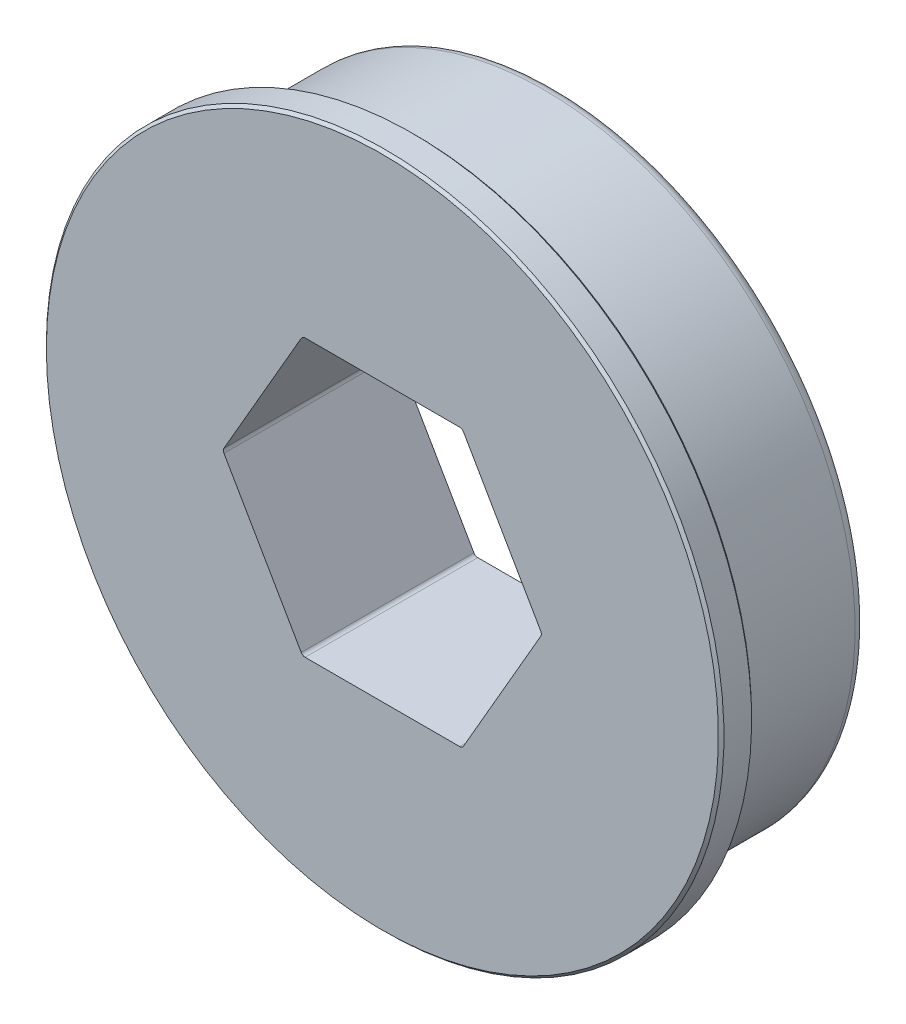
ISO-10303-21;
HEADER;
FILE_DESCRIPTION(('STEP AP214'),'2;1');
FILE_NAME('part.step','',(''),(''),'','','');
FILE_SCHEMA(('AUTOMOTIVE_DESIGN { 1 0 10303 214 1 1 1 1 }'));
ENDSEC;
DATA;
#1=APPLICATION_CONTEXT('core data for automotive mechanical design processes');
#2=APPLICATION_PROTOCOL_DEFINITION('international standard','automotive_design',2000,#1);
#3=PRODUCT_CONTEXT('',#1,'mechanical');
#4=PRODUCT('Part','Part','',(#3));
#5=PRODUCT_RELATED_PRODUCT_CATEGORY('part','',(#4));
#6=PRODUCT_DEFINITION_FORMATION('','',#4);
#7=PRODUCT_DEFINITION_CONTEXT('part definition',#1,'design');
#8=PRODUCT_DEFINITION('design','',#6,#7);
#9=PRODUCT_DEFINITION_SHAPE('','',#8);
#10=(LENGTH_UNIT() NAMED_UNIT(*) SI_UNIT(.MILLI.,.METRE.));
#11=(NAMED_UNIT(*) PLANE_ANGLE_UNIT() SI_UNIT($,.RADIAN.));
#12=(NAMED_UNIT(*) SI_UNIT($,.STERADIAN.) SOLID_ANGLE_UNIT());
#13=UNCERTAINTY_MEASURE_WITH_UNIT(LENGTH_MEASURE(1.E-05),#10,'distance_accuracy_value','');
#14=(GEOMETRIC_REPRESENTATION_CONTEXT(3) GLOBAL_UNCERTAINTY_ASSIGNED_CONTEXT((#13)) GLOBAL_UNIT_ASSIGNED_CONTEXT((#10,
#11,#12)) REPRESENTATION_CONTEXT('',''));
#15=CARTESIAN_POINT('',(0.,0.,0.));
#16=DIRECTION('',(0.,0.,1.));
#17=DIRECTION('',(1.,0.,0.));
#18=AXIS2_PLACEMENT_3D('',#15,#16,#17);
#19=CARTESIAN_POINT('',(0.,0.,7.92734));
#20=DIRECTION('',(0.,0.,-1.));
#21=DIRECTION('',(-1.,0.,0.));
#22=AXIS2_PLACEMENT_3D('',#19,#20,#21);
#23=CYLINDRICAL_SURFACE('',#22,13.97);
#24=CARTESIAN_POINT('',(0.,0.,6.40333999999999));
#25=DIRECTION('',(0.,0.,-1.));
#26=DIRECTION('',(-1.,0.,0.));
#27=AXIS2_PLACEMENT_3D('',#24,#25,#26);
#28=CIRCLE('',#27,13.97);
#29=CARTESIAN_POINT('',(-13.97,0.,6.40333999999999));
#30=VERTEX_POINT('',#29);
#31=EDGE_CURVE('E252',#30,#30,#28,.F.);
#32=ORIENTED_EDGE('',*,*,#31,.F.);
#33=EDGE_LOOP('',(#32));
#34=FACE_BOUND('',#33,.T.);
#35=CARTESIAN_POINT('',(0.,0.,5.89534));
#36=DIRECTION('',(0.,0.,-1.));
#37=DIRECTION('',(-1.,0.,0.));
#38=AXIS2_PLACEMENT_3D('',#35,#36,#37);
#39=CIRCLE('',#38,13.97);
#40=CARTESIAN_POINT('',(-13.97,0.,5.89534));
#41=VERTEX_POINT('',#40);
#42=EDGE_CURVE('E19',#41,#41,#39,.T.);
#43=ORIENTED_EDGE('',*,*,#42,.F.);
#44=EDGE_LOOP('',(#43));
#45=FACE_BOUND('',#44,.T.);
#46=ADVANCED_FACE('F16',(#34,#45),#23,.T.);
#47=CARTESIAN_POINT('',(14.2875,0.,5.89534));
#48=DIRECTION('',(0.,0.,1.));
#49=DIRECTION('',(1.,0.,0.));
#50=AXIS2_PLACEMENT_3D('',#47,#48,#49);
#51=PLANE('',#50);
#52=ORIENTED_EDGE('',*,*,#42,.T.);
#53=EDGE_LOOP('',(#52));
#54=FACE_BOUND('',#53,.T.);
#55=CARTESIAN_POINT('',(0.,0.,5.89534));
#56=DIRECTION('',(0.,0.,-1.));
#57=DIRECTION('',(-1.,0.,0.));
#58=AXIS2_PLACEMENT_3D('',#55,#56,#57);
#59=CIRCLE('',#58,14.2875);
#60=CARTESIAN_POINT('',(-14.2875,0.,5.89534));
#61=VERTEX_POINT('',#60);
#62=EDGE_CURVE('E250',#61,#61,#59,.T.);
#63=ORIENTED_EDGE('',*,*,#62,.F.);
#64=EDGE_LOOP('',(#63));
#65=FACE_BOUND('',#64,.T.);
#66=ADVANCED_FACE('F259',(#54,#65),#51,.T.);
#67=CARTESIAN_POINT('',(13.97,0.,6.40334));
#68=DIRECTION('',(0.,0.,-1.));
#69=DIRECTION('',(-1.,0.,0.));
#70=AXIS2_PLACEMENT_3D('',#67,#68,#69);
#71=PLANE('',#70);
#72=ORIENTED_EDGE('',*,*,#31,.T.);
#73=EDGE_LOOP('',(#72));
#74=FACE_BOUND('',#73,.T.);
#75=CARTESIAN_POINT('',(0.,0.,6.40334));
#76=DIRECTION('',(0.,0.,1.));
#77=DIRECTION('',(0.,-1.,0.));
#78=AXIS2_PLACEMENT_3D('',#75,#76,#77);
#79=CIRCLE('',#78,15.4305);
#80=CARTESIAN_POINT('',(0.,-15.4305,6.40334));
#81=VERTEX_POINT('',#80);
#82=EDGE_CURVE('E247',#81,#81,#79,.T.);
#83=ORIENTED_EDGE('',*,*,#82,.F.);
#84=EDGE_LOOP('',(#83));
#85=FACE_BOUND('',#84,.T.);
#86=ADVANCED_FACE('F268',(#74,#85),#71,.T.);
#87=CARTESIAN_POINT('',(0.,0.,7.92734));
#88=DIRECTION('',(0.,0.,-1.));
#89=DIRECTION('',(-1.,0.,0.));
#90=AXIS2_PLACEMENT_3D('',#87,#88,#89);
#91=CYLINDRICAL_SURFACE('',#90,14.2875);
#92=ORIENTED_EDGE('',*,*,#62,.T.);
#93=EDGE_LOOP('',(#92));
#94=FACE_BOUND('',#93,.T.);
#95=CARTESIAN_POINT('',(0.,0.,0.508));
#96=DIRECTION('',(0.,0.,-1.));
#97=DIRECTION('',(-1.,0.,0.));
#98=AXIS2_PLACEMENT_3D('',#95,#96,#97);
#99=CIRCLE('',#98,14.2875);
#100=CARTESIAN_POINT('',(-14.2875,0.,0.508));
#101=VERTEX_POINT('',#100);
#102=EDGE_CURVE('E191',#101,#101,#99,.T.);
#103=ORIENTED_EDGE('',*,*,#102,.F.);
#104=EDGE_LOOP('',(#103));
#105=FACE_BOUND('',#104,.T.);
#106=ADVANCED_FACE('F312',(#94,#105),#91,.T.);
#107=CARTESIAN_POINT('',(0.,0.,6.53034));
#108=DIRECTION('',(0.,0.,1.));
#109=DIRECTION('',(0.,-1.,0.));
#110=AXIS2_PLACEMENT_3D('',#107,#108,#109);
#111=CONICAL_SURFACE('',#110,15.5575,0.785398163397469);
#112=ORIENTED_EDGE('',*,*,#82,.T.);
#113=EDGE_LOOP('',(#112));
#114=FACE_BOUND('',#113,.T.);
#115=CARTESIAN_POINT('',(0.,0.,6.53034000000001));
#116=DIRECTION('',(0.,0.,-1.));
#117=DIRECTION('',(-1.,0.,0.));
#118=AXIS2_PLACEMENT_3D('',#115,#116,#117);
#119=CIRCLE('',#118,15.5575);
#120=CARTESIAN_POINT('',(-15.5575,0.,6.53034000000001));
#121=VERTEX_POINT('',#120);
#122=EDGE_CURVE('E81',#121,#121,#119,.F.);
#123=ORIENTED_EDGE('',*,*,#122,.F.);
#124=EDGE_LOOP('',(#123));
#125=FACE_BOUND('',#124,.T.);
#126=ADVANCED_FACE('F209',(#114,#125),#111,.T.);
#127=CARTESIAN_POINT('',(0.,0.,0.508));
#128=DIRECTION('',(0.,0.,-1.));
#129=DIRECTION('',(-1.,0.,0.));
#130=AXIS2_PLACEMENT_3D('',#127,#128,#129);
#131=TOROIDAL_SURFACE('',#130,13.7795,0.508);
#132=ORIENTED_EDGE('',*,*,#102,.T.);
#133=EDGE_LOOP('',(#132));
#134=FACE_BOUND('',#133,.T.);
#135=CARTESIAN_POINT('',(0.,0.,0.));
#136=DIRECTION('',(0.,0.,1.));
#137=DIRECTION('',(-1.,0.,0.));
#138=AXIS2_PLACEMENT_3D('',#135,#136,#137);
#139=CIRCLE('',#138,13.7795);
#140=CARTESIAN_POINT('',(13.7795,0.,0.));
#141=VERTEX_POINT('',#140);
#142=CARTESIAN_POINT('',(-13.7795,0.,0.));
#143=VERTEX_POINT('',#142);
#144=EDGE_CURVE('E231',#141,#143,#139,.F.);
#145=ORIENTED_EDGE('',*,*,#144,.F.);
#146=CARTESIAN_POINT('',(0.,0.,0.));
#147=DIRECTION('',(0.,0.,1.));
#148=DIRECTION('',(1.,0.,0.));
#149=AXIS2_PLACEMENT_3D('',#146,#147,#148);
#150=CIRCLE('',#149,13.7795);
#151=EDGE_CURVE('E150',#143,#141,#150,.F.);
#152=ORIENTED_EDGE('',*,*,#151,.F.);
#153=EDGE_LOOP('',(#145,#152));
#154=FACE_BOUND('',#153,.T.);
#155=ADVANCED_FACE('F203',(#134,#154),#131,.T.);
#156=CARTESIAN_POINT('',(0.,0.,7.92734));
#157=DIRECTION('',(0.,0.,-1.));
#158=DIRECTION('',(-1.,0.,0.));
#159=AXIS2_PLACEMENT_3D('',#156,#157,#158);
#160=CYLINDRICAL_SURFACE('',#159,15.5575);
#161=CARTESIAN_POINT('',(0.,0.,7.80034));
#162=DIRECTION('',(0.,0.,-1.));
#163=DIRECTION('',(-1.,0.,0.));
#164=AXIS2_PLACEMENT_3D('',#161,#162,#163);
#165=CIRCLE('',#164,15.5575);
#166=CARTESIAN_POINT('',(-15.5575,0.,7.80034));
#167=VERTEX_POINT('',#166);
#168=EDGE_CURVE('E141',#167,#167,#165,.F.);
#169=ORIENTED_EDGE('',*,*,#168,.F.);
#170=EDGE_LOOP('',(#169));
#171=FACE_BOUND('',#170,.T.);
#172=ORIENTED_EDGE('',*,*,#122,.T.);
#173=EDGE_LOOP('',(#172));
#174=FACE_BOUND('',#173,.T.);
#175=ADVANCED_FACE('F208',(#171,#174),#160,.T.);
#176=CARTESIAN_POINT('',(-7.09771326930958,0.,7.92734));
#177=DIRECTION('',(0.,0.,1.));
#178=DIRECTION('',(1.,0.,0.));
#179=AXIS2_PLACEMENT_3D('',#176,#177,#178);
#180=CYLINDRICAL_SURFACE('',#179,0.2032);
#181=DIRECTION('',(0.,0.,1.));
#182=VECTOR('',#181,1.);
#183=CARTESIAN_POINT('',(-7.27368963135857,-0.101600000000004,7.92734));
#184=LINE('',#183,#182);
#185=CARTESIAN_POINT('',(-7.27368963135857,-0.101600000000003,7.92734));
#186=VERTEX_POINT('',#185);
#187=CARTESIAN_POINT('',(-7.27368963135857,-0.101600000000003,0.));
#188=VERTEX_POINT('',#187);
#189=EDGE_CURVE('E139',#186,#188,#184,.F.);
#190=ORIENTED_EDGE('',*,*,#189,.T.);
#191=CARTESIAN_POINT('',(-7.09771326930958,0.,0.));
#192=DIRECTION('',(0.,0.,1.));
#193=DIRECTION('',(1.,0.,0.));
#194=AXIS2_PLACEMENT_3D('',#191,#192,#193);
#195=CIRCLE('',#194,0.2032);
#196=CARTESIAN_POINT('',(-7.27368963135857,0.101599999999994,0.));
#197=VERTEX_POINT('',#196);
#198=EDGE_CURVE('E89',#197,#188,#195,.T.);
#199=ORIENTED_EDGE('',*,*,#198,.F.);
#200=DIRECTION('',(0.,0.,1.));
#201=VECTOR('',#200,1.);
#202=CARTESIAN_POINT('',(-7.27368963135857,0.101599999999995,7.92734));
#203=LINE('',#202,#201);
#204=CARTESIAN_POINT('',(-7.27368963135857,0.101599999999993,7.92734));
#205=VERTEX_POINT('',#204);
#206=EDGE_CURVE('E85',#197,#205,#203,.T.);
#207=ORIENTED_EDGE('',*,*,#206,.T.);
#208=CARTESIAN_POINT('',(-7.09771326930958,0.,7.92734));
#209=DIRECTION('',(0.,0.,1.));
#210=DIRECTION('',(1.,0.,0.));
#211=AXIS2_PLACEMENT_3D('',#208,#209,#210);
#212=CIRCLE('',#211,0.2032);
#213=EDGE_CURVE('E69',#186,#205,#212,.F.);
#214=ORIENTED_EDGE('',*,*,#213,.F.);
#215=EDGE_LOOP('',(#190,#199,#207,#214));
#216=FACE_BOUND('',#215,.T.);
#217=ADVANCED_FACE('F86',(#216),#180,.F.);
#218=CARTESIAN_POINT('',(-3.54885663465479,6.14679999999999,7.92734));
#219=DIRECTION('',(0.,0.,1.));
#220=DIRECTION('',(1.,0.,0.));
#221=AXIS2_PLACEMENT_3D('',#218,#219,#220);
#222=CYLINDRICAL_SURFACE('',#221,0.2032);
#223=DIRECTION('',(0.,0.,1.));
#224=VECTOR('',#223,1.);
#225=CARTESIAN_POINT('',(-3.72483299670379,6.24839999999999,7.92734));
#226=LINE('',#225,#224);
#227=CARTESIAN_POINT('',(-3.72483299670379,6.24839999999999,7.92734));
#228=VERTEX_POINT('',#227);
#229=CARTESIAN_POINT('',(-3.72483299670379,6.24839999999999,0.));
#230=VERTEX_POINT('',#229);
#231=EDGE_CURVE('E99',#228,#230,#226,.F.);
#232=ORIENTED_EDGE('',*,*,#231,.T.);
#233=CARTESIAN_POINT('',(-3.54885663465479,6.14679999999999,0.));
#234=DIRECTION('',(0.,0.,1.));
#235=DIRECTION('',(1.,0.,0.));
#236=AXIS2_PLACEMENT_3D('',#233,#234,#235);
#237=CIRCLE('',#236,0.2032);
#238=CARTESIAN_POINT('',(-3.54885663465479,6.34999999999999,0.));
#239=VERTEX_POINT('',#238);
#240=EDGE_CURVE('E473',#239,#230,#237,.T.);
#241=ORIENTED_EDGE('',*,*,#240,.F.);
#242=DIRECTION('',(0.,0.,1.));
#243=VECTOR('',#242,1.);
#244=CARTESIAN_POINT('',(-3.54885663465479,6.34999999999999,7.92734));
#245=LINE('',#244,#243);
#246=CARTESIAN_POINT('',(-3.54885663465479,6.34999999999999,7.92734));
#247=VERTEX_POINT('',#246);
#248=EDGE_CURVE('E93',#239,#247,#245,.T.);
#249=ORIENTED_EDGE('',*,*,#248,.T.);
#250=CARTESIAN_POINT('',(-3.54885663465479,6.14679999999999,7.92734));
#251=DIRECTION('',(0.,0.,1.));
#252=DIRECTION('',(1.,0.,0.));
#253=AXIS2_PLACEMENT_3D('',#250,#251,#252);
#254=CIRCLE('',#253,0.2032);
#255=EDGE_CURVE('E80',#228,#247,#254,.F.);
#256=ORIENTED_EDGE('',*,*,#255,.F.);
#257=EDGE_LOOP('',(#232,#241,#249,#256));
#258=FACE_BOUND('',#257,.T.);
#259=ADVANCED_FACE('F360',(#258),#222,.F.);
#260=CARTESIAN_POINT('',(3.5488566346548,6.1468,7.92734));
#261=DIRECTION('',(0.,0.,1.));
#262=DIRECTION('',(1.,0.,0.));
#263=AXIS2_PLACEMENT_3D('',#260,#261,#262);
#264=CYLINDRICAL_SURFACE('',#263,0.2032);
#265=DIRECTION('',(0.,0.,1.));
#266=VECTOR('',#265,1.);
#267=CARTESIAN_POINT('',(3.5488566346548,6.34999999999999,7.92734));
#268=LINE('',#267,#266);
#269=CARTESIAN_POINT('',(3.5488566346548,6.34999999999999,7.92734));
#270=VERTEX_POINT('',#269);
#271=CARTESIAN_POINT('',(3.5488566346548,6.34999999999999,0.));
#272=VERTEX_POINT('',#271);
#273=EDGE_CURVE('E132',#270,#272,#268,.F.);
#274=ORIENTED_EDGE('',*,*,#273,.T.);
#275=CARTESIAN_POINT('',(3.5488566346548,6.1468,0.));
#276=DIRECTION('',(0.,0.,1.));
#277=DIRECTION('',(1.,0.,0.));
#278=AXIS2_PLACEMENT_3D('',#275,#276,#277);
#279=CIRCLE('',#278,0.2032);
#280=CARTESIAN_POINT('',(3.7248329967038,6.2484,0.));
#281=VERTEX_POINT('',#280);
#282=EDGE_CURVE('E477',#281,#272,#279,.T.);
#283=ORIENTED_EDGE('',*,*,#282,.F.);
#284=DIRECTION('',(0.,0.,1.));
#285=VECTOR('',#284,1.);
#286=CARTESIAN_POINT('',(3.7248329967038,6.2484,7.92734));
#287=LINE('',#286,#285);
#288=CARTESIAN_POINT('',(3.7248329967038,6.2484,7.92734));
#289=VERTEX_POINT('',#288);
#290=EDGE_CURVE('E122',#281,#289,#287,.T.);
#291=ORIENTED_EDGE('',*,*,#290,.T.);
#292=CARTESIAN_POINT('',(3.5488566346548,6.1468,7.92734));
#293=DIRECTION('',(0.,0.,1.));
#294=DIRECTION('',(1.,0.,0.));
#295=AXIS2_PLACEMENT_3D('',#292,#293,#294);
#296=CIRCLE('',#295,0.2032);
#297=EDGE_CURVE('E244',#270,#289,#296,.F.);
#298=ORIENTED_EDGE('',*,*,#297,.F.);
#299=EDGE_LOOP('',(#274,#283,#291,#298));
#300=FACE_BOUND('',#299,.T.);
#301=ADVANCED_FACE('F368',(#300),#264,.F.);
#302=CARTESIAN_POINT('',(7.09771326930959,0.,7.92734));
#303=DIRECTION('',(0.,0.,1.));
#304=DIRECTION('',(1.,0.,0.));
#305=AXIS2_PLACEMENT_3D('',#302,#303,#304);
#306=CYLINDRICAL_SURFACE('',#305,0.2032);
#307=DIRECTION('',(0.,0.,1.));
#308=VECTOR('',#307,1.);
#309=CARTESIAN_POINT('',(7.27368963135859,-0.101600000000002,7.92734));
#310=LINE('',#309,#308);
#311=CARTESIAN_POINT('',(7.27368963135859,-0.101600000000003,0.));
#312=VERTEX_POINT('',#311);
#313=CARTESIAN_POINT('',(7.27368963135859,-0.101600000000004,7.92734));
#314=VERTEX_POINT('',#313);
#315=EDGE_CURVE('E115',#312,#314,#310,.T.);
#316=ORIENTED_EDGE('',*,*,#315,.T.);
#317=CARTESIAN_POINT('',(7.09771326930959,0.,7.92734));
#318=DIRECTION('',(0.,0.,1.));
#319=DIRECTION('',(1.,0.,0.));
#320=AXIS2_PLACEMENT_3D('',#317,#318,#319);
#321=CIRCLE('',#320,0.2032);
#322=CARTESIAN_POINT('',(7.27368963135859,0.101599999999996,7.92734));
#323=VERTEX_POINT('',#322);
#324=EDGE_CURVE('E242',#323,#314,#321,.F.);
#325=ORIENTED_EDGE('',*,*,#324,.F.);
#326=DIRECTION('',(0.,0.,1.));
#327=VECTOR('',#326,1.);
#328=CARTESIAN_POINT('',(7.27368963135859,0.101599999999995,7.92734));
#329=LINE('',#328,#327);
#330=CARTESIAN_POINT('',(7.27368963135859,0.101599999999995,0.));
#331=VERTEX_POINT('',#330);
#332=EDGE_CURVE('E126',#323,#331,#329,.F.);
#333=ORIENTED_EDGE('',*,*,#332,.T.);
#334=CARTESIAN_POINT('',(7.09771326930959,0.,0.));
#335=DIRECTION('',(0.,0.,1.));
#336=DIRECTION('',(1.,0.,0.));
#337=AXIS2_PLACEMENT_3D('',#334,#335,#336);
#338=CIRCLE('',#337,0.2032);
#339=EDGE_CURVE('E237',#312,#331,#338,.T.);
#340=ORIENTED_EDGE('',*,*,#339,.F.);
#341=EDGE_LOOP('',(#316,#325,#333,#340));
#342=FACE_BOUND('',#341,.T.);
#343=ADVANCED_FACE('F378',(#342),#306,.F.);
#344=CARTESIAN_POINT('',(-3.54885663465478,-6.14680000000001,7.92734));
#345=DIRECTION('',(0.,0.,1.));
#346=DIRECTION('',(1.,0.,0.));
#347=AXIS2_PLACEMENT_3D('',#344,#345,#346);
#348=CYLINDRICAL_SURFACE('',#347,0.2032);
#349=DIRECTION('',(0.,0.,-1.));
#350=VECTOR('',#349,1.);
#351=CARTESIAN_POINT('',(-3.54885663465478,-6.35000000000001,7.92734));
#352=LINE('',#351,#350);
#353=CARTESIAN_POINT('',(-3.54885663465478,-6.35000000000001,7.92734));
#354=VERTEX_POINT('',#353);
#355=CARTESIAN_POINT('',(-3.54885663465478,-6.35000000000001,0.));
#356=VERTEX_POINT('',#355);
#357=EDGE_CURVE('E113',#354,#356,#352,.T.);
#358=ORIENTED_EDGE('',*,*,#357,.T.);
#359=CARTESIAN_POINT('',(-3.54885663465478,-6.14680000000001,0.));
#360=DIRECTION('',(0.,0.,1.));
#361=DIRECTION('',(1.,0.,0.));
#362=AXIS2_PLACEMENT_3D('',#359,#360,#361);
#363=CIRCLE('',#362,0.2032);
#364=CARTESIAN_POINT('',(-3.72483299670378,-6.24840000000001,0.));
#365=VERTEX_POINT('',#364);
#366=EDGE_CURVE('E233',#365,#356,#363,.T.);
#367=ORIENTED_EDGE('',*,*,#366,.F.);
#368=DIRECTION('',(0.,0.,1.));
#369=VECTOR('',#368,1.);
#370=CARTESIAN_POINT('',(-3.72483299670378,-6.24840000000001,7.92734));
#371=LINE('',#370,#369);
#372=CARTESIAN_POINT('',(-3.72483299670378,-6.24840000000001,7.92734));
#373=VERTEX_POINT('',#372);
#374=EDGE_CURVE('E136',#365,#373,#371,.T.);
#375=ORIENTED_EDGE('',*,*,#374,.T.);
#376=CARTESIAN_POINT('',(-3.54885663465478,-6.14680000000001,7.92734));
#377=DIRECTION('',(0.,0.,1.));
#378=DIRECTION('',(1.,0.,0.));
#379=AXIS2_PLACEMENT_3D('',#376,#377,#378);
#380=CIRCLE('',#379,0.2032);
#381=EDGE_CURVE('E34',#354,#373,#380,.F.);
#382=ORIENTED_EDGE('',*,*,#381,.F.);
#383=EDGE_LOOP('',(#358,#367,#375,#382));
#384=FACE_BOUND('',#383,.T.);
#385=ADVANCED_FACE('F167',(#384),#348,.F.);
#386=CARTESIAN_POINT('',(0.,0.,0.));
#387=DIRECTION('',(0.,0.,-1.));
#388=DIRECTION('',(-1.,0.,0.));
#389=AXIS2_PLACEMENT_3D('',#386,#387,#388);
#390=PLANE('',#389);
#391=DIRECTION('',(-1.,0.,0.));
#392=VECTOR('',#391,1.);
#393=CARTESIAN_POINT('',(-3.66617420935412,6.34999999999999,0.));
#394=LINE('',#393,#392);
#395=EDGE_CURVE('E129',#272,#239,#394,.T.);
#396=ORIENTED_EDGE('',*,*,#395,.T.);
#397=ORIENTED_EDGE('',*,*,#240,.T.);
#398=DIRECTION('',(-0.5,-0.866025403784439,0.));
#399=VECTOR('',#398,1.);
#400=CARTESIAN_POINT('',(-7.33234841870824,0.,0.));
#401=LINE('',#400,#399);
#402=EDGE_CURVE('E94',#230,#197,#401,.T.);
#403=ORIENTED_EDGE('',*,*,#402,.T.);
#404=ORIENTED_EDGE('',*,*,#198,.T.);
#405=DIRECTION('',(0.5,-0.866025403784439,0.));
#406=VECTOR('',#405,1.);
#407=CARTESIAN_POINT('',(-3.66617420935411,-6.35000000000001,0.));
#408=LINE('',#407,#406);
#409=EDGE_CURVE('E138',#188,#365,#408,.T.);
#410=ORIENTED_EDGE('',*,*,#409,.T.);
#411=ORIENTED_EDGE('',*,*,#366,.T.);
#412=DIRECTION('',(1.,0.,0.));
#413=VECTOR('',#412,1.);
#414=CARTESIAN_POINT('',(3.66617420935413,-6.35000000000001,0.));
#415=LINE('',#414,#413);
#416=CARTESIAN_POINT('',(3.5488566346548,-6.35000000000001,0.));
#417=VERTEX_POINT('',#416);
#418=EDGE_CURVE('E112',#356,#417,#415,.T.);
#419=ORIENTED_EDGE('',*,*,#418,.T.);
#420=CARTESIAN_POINT('',(3.5488566346548,-6.14680000000001,0.));
#421=DIRECTION('',(0.,0.,1.));
#422=DIRECTION('',(1.,0.,0.));
#423=AXIS2_PLACEMENT_3D('',#420,#421,#422);
#424=CIRCLE('',#423,0.2032);
#425=CARTESIAN_POINT('',(3.72483299670379,-6.24840000000001,0.));
#426=VERTEX_POINT('',#425);
#427=EDGE_CURVE('E470',#417,#426,#424,.T.);
#428=ORIENTED_EDGE('',*,*,#427,.T.);
#429=DIRECTION('',(0.5,0.866025403784439,0.));
#430=VECTOR('',#429,1.);
#431=CARTESIAN_POINT('',(7.33234841870825,0.,0.));
#432=LINE('',#431,#430);
#433=EDGE_CURVE('E118',#426,#312,#432,.T.);
#434=ORIENTED_EDGE('',*,*,#433,.T.);
#435=ORIENTED_EDGE('',*,*,#339,.T.);
#436=DIRECTION('',(-0.5,0.866025403784439,0.));
#437=VECTOR('',#436,1.);
#438=CARTESIAN_POINT('',(3.66617420935413,6.35,0.));
#439=LINE('',#438,#437);
#440=EDGE_CURVE('E125',#331,#281,#439,.T.);
#441=ORIENTED_EDGE('',*,*,#440,.T.);
#442=ORIENTED_EDGE('',*,*,#282,.T.);
#443=EDGE_LOOP('',(#396,#397,#403,#404,#410,#411,#419,#428,#434,#435,#441,#442));
#444=FACE_BOUND('',#443,.T.);
#445=ORIENTED_EDGE('',*,*,#151,.T.);
#446=ORIENTED_EDGE('',*,*,#144,.T.);
#447=EDGE_LOOP('',(#445,#446));
#448=FACE_BOUND('',#447,.T.);
#449=ADVANCED_FACE('F156',(#444,#448),#390,.T.);
#450=CARTESIAN_POINT('',(3.5488566346548,-6.14680000000001,7.92734));
#451=DIRECTION('',(0.,0.,1.));
#452=DIRECTION('',(1.,0.,0.));
#453=AXIS2_PLACEMENT_3D('',#450,#451,#452);
#454=CYLINDRICAL_SURFACE('',#453,0.2032);
#455=DIRECTION('',(0.,0.,1.));
#456=VECTOR('',#455,1.);
#457=CARTESIAN_POINT('',(3.72483299670379,-6.24840000000001,7.92734));
#458=LINE('',#457,#456);
#459=CARTESIAN_POINT('',(3.7248329967038,-6.24840000000001,7.92734));
#460=VERTEX_POINT('',#459);
#461=EDGE_CURVE('E119',#460,#426,#458,.F.);
#462=ORIENTED_EDGE('',*,*,#461,.T.);
#463=ORIENTED_EDGE('',*,*,#427,.F.);
#464=DIRECTION('',(0.,0.,-1.));
#465=VECTOR('',#464,1.);
#466=CARTESIAN_POINT('',(3.5488566346548,-6.35000000000001,7.92734));
#467=LINE('',#466,#465);
#468=CARTESIAN_POINT('',(3.5488566346548,-6.35000000000001,7.92734));
#469=VERTEX_POINT('',#468);
#470=EDGE_CURVE('E109',#417,#469,#467,.F.);
#471=ORIENTED_EDGE('',*,*,#470,.T.);
#472=CARTESIAN_POINT('',(3.5488566346548,-6.14680000000001,7.92734));
#473=DIRECTION('',(0.,0.,1.));
#474=DIRECTION('',(1.,0.,0.));
#475=AXIS2_PLACEMENT_3D('',#472,#473,#474);
#476=CIRCLE('',#475,0.2032);
#477=EDGE_CURVE('E196',#460,#469,#476,.F.);
#478=ORIENTED_EDGE('',*,*,#477,.F.);
#479=EDGE_LOOP('',(#462,#463,#471,#478));
#480=FACE_BOUND('',#479,.T.);
#481=ADVANCED_FACE('F166',(#480),#454,.F.);
#482=CARTESIAN_POINT('',(0.,0.,7.80034));
#483=DIRECTION('',(0.,0.,-1.));
#484=DIRECTION('',(-1.,0.,0.));
#485=AXIS2_PLACEMENT_3D('',#482,#483,#484);
#486=CONICAL_SURFACE('',#485,15.5575,0.785398163397442);
#487=CARTESIAN_POINT('',(0.,0.,7.92734));
#488=DIRECTION('',(0.,0.,-1.));
#489=DIRECTION('',(-1.,0.,0.));
#490=AXIS2_PLACEMENT_3D('',#487,#488,#489);
#491=CIRCLE('',#490,15.4305);
#492=CARTESIAN_POINT('',(-15.4305,0.,7.92734));
#493=VERTEX_POINT('',#492);
#494=EDGE_CURVE('E105',#493,#493,#491,.F.);
#495=ORIENTED_EDGE('',*,*,#494,.F.);
#496=EDGE_LOOP('',(#495));
#497=FACE_BOUND('',#496,.T.);
#498=ORIENTED_EDGE('',*,*,#168,.T.);
#499=EDGE_LOOP('',(#498));
#500=FACE_BOUND('',#499,.T.);
#501=ADVANCED_FACE('F294',(#497,#500),#486,.T.);
#502=CARTESIAN_POINT('',(-3.66617420935411,-6.35000000000001,7.92734));
#503=DIRECTION('',(-0.866025403784439,-0.5,0.));
#504=DIRECTION('',(0.5,-0.866025403784439,0.));
#505=AXIS2_PLACEMENT_3D('',#502,#503,#504);
#506=PLANE('',#505);
#507=ORIENTED_EDGE('',*,*,#374,.F.);
#508=ORIENTED_EDGE('',*,*,#409,.F.);
#509=ORIENTED_EDGE('',*,*,#189,.F.);
#510=DIRECTION('',(-0.5,0.866025403784439,0.));
#511=VECTOR('',#510,1.);
#512=CARTESIAN_POINT('',(-3.72483299670378,-6.24840000000001,7.92734));
#513=LINE('',#512,#511);
#514=EDGE_CURVE('E79',#373,#186,#513,.T.);
#515=ORIENTED_EDGE('',*,*,#514,.F.);
#516=EDGE_LOOP('',(#507,#508,#509,#515));
#517=FACE_BOUND('',#516,.T.);
#518=ADVANCED_FACE('F292',(#517),#506,.F.);
#519=CARTESIAN_POINT('',(-7.33234841870824,0.,7.92734));
#520=DIRECTION('',(-0.866025403784439,0.5,0.));
#521=DIRECTION('',(-0.5,-0.866025403784439,0.));
#522=AXIS2_PLACEMENT_3D('',#519,#520,#521);
#523=PLANE('',#522);
#524=ORIENTED_EDGE('',*,*,#206,.F.);
#525=ORIENTED_EDGE('',*,*,#402,.F.);
#526=ORIENTED_EDGE('',*,*,#231,.F.);
#527=DIRECTION('',(0.499999999999999,0.866025403784439,0.));
#528=VECTOR('',#527,1.);
#529=CARTESIAN_POINT('',(-7.27368963135857,0.101599999999993,7.92734));
#530=LINE('',#529,#528);
#531=EDGE_CURVE('E77',#205,#228,#530,.T.);
#532=ORIENTED_EDGE('',*,*,#531,.F.);
#533=EDGE_LOOP('',(#524,#525,#526,#532));
#534=FACE_BOUND('',#533,.T.);
#535=ADVANCED_FACE('F97',(#534),#523,.F.);
#536=CARTESIAN_POINT('',(-3.66617420935412,6.34999999999999,7.92734));
#537=DIRECTION('',(0.,1.,0.));
#538=DIRECTION('',(-1.,0.,0.));
#539=AXIS2_PLACEMENT_3D('',#536,#537,#538);
#540=PLANE('',#539);
#541=ORIENTED_EDGE('',*,*,#273,.F.);
#542=DIRECTION('',(1.,0.,0.));
#543=VECTOR('',#542,1.);
#544=CARTESIAN_POINT('',(15.5575,6.34999999999999,7.92734));
#545=LINE('',#544,#543);
#546=EDGE_CURVE('E100',#247,#270,#545,.T.);
#547=ORIENTED_EDGE('',*,*,#546,.F.);
#548=ORIENTED_EDGE('',*,*,#248,.F.);
#549=ORIENTED_EDGE('',*,*,#395,.F.);
#550=EDGE_LOOP('',(#541,#547,#548,#549));
#551=FACE_BOUND('',#550,.T.);
#552=ADVANCED_FACE('F285',(#551),#540,.F.);
#553=CARTESIAN_POINT('',(3.66617420935413,6.35,7.92734));
#554=DIRECTION('',(0.866025403784439,0.5,0.));
#555=DIRECTION('',(-0.5,0.866025403784439,0.));
#556=AXIS2_PLACEMENT_3D('',#553,#554,#555);
#557=PLANE('',#556);
#558=ORIENTED_EDGE('',*,*,#290,.F.);
#559=ORIENTED_EDGE('',*,*,#440,.F.);
#560=ORIENTED_EDGE('',*,*,#332,.F.);
#561=DIRECTION('',(0.5,-0.866025403784439,0.));
#562=VECTOR('',#561,1.);
#563=CARTESIAN_POINT('',(3.7248329967038,6.2484,7.92734));
#564=LINE('',#563,#562);
#565=EDGE_CURVE('E103',#289,#323,#564,.T.);
#566=ORIENTED_EDGE('',*,*,#565,.F.);
#567=EDGE_LOOP('',(#558,#559,#560,#566));
#568=FACE_BOUND('',#567,.T.);
#569=ADVANCED_FACE('F281',(#568),#557,.F.);
#570=CARTESIAN_POINT('',(7.33234841870825,0.,7.92734));
#571=DIRECTION('',(0.866025403784439,-0.5,0.));
#572=DIRECTION('',(0.5,0.866025403784439,0.));
#573=AXIS2_PLACEMENT_3D('',#570,#571,#572);
#574=PLANE('',#573);
#575=ORIENTED_EDGE('',*,*,#315,.F.);
#576=ORIENTED_EDGE('',*,*,#433,.F.);
#577=ORIENTED_EDGE('',*,*,#461,.F.);
#578=DIRECTION('',(-0.5,-0.866025403784439,0.));
#579=VECTOR('',#578,1.);
#580=CARTESIAN_POINT('',(7.27368963135859,-0.101600000000005,7.92734));
#581=LINE('',#580,#579);
#582=EDGE_CURVE('E25',#314,#460,#581,.T.);
#583=ORIENTED_EDGE('',*,*,#582,.F.);
#584=EDGE_LOOP('',(#575,#576,#577,#583));
#585=FACE_BOUND('',#584,.T.);
#586=ADVANCED_FACE('F275',(#585),#574,.F.);
#587=CARTESIAN_POINT('',(3.66617420935413,-6.35000000000001,7.92734));
#588=DIRECTION('',(0.,-1.,0.));
#589=DIRECTION('',(0.,0.,-1.));
#590=AXIS2_PLACEMENT_3D('',#587,#588,#589);
#591=PLANE('',#590);
#592=ORIENTED_EDGE('',*,*,#470,.F.);
#593=ORIENTED_EDGE('',*,*,#418,.F.);
#594=ORIENTED_EDGE('',*,*,#357,.F.);
#595=DIRECTION('',(1.,0.,0.));
#596=VECTOR('',#595,1.);
#597=CARTESIAN_POINT('',(15.5575,-6.35000000000001,7.92734));
#598=LINE('',#597,#596);
#599=EDGE_CURVE('E11',#469,#354,#598,.F.);
#600=ORIENTED_EDGE('',*,*,#599,.F.);
#601=EDGE_LOOP('',(#592,#593,#594,#600));
#602=FACE_BOUND('',#601,.T.);
#603=ADVANCED_FACE('F270',(#602),#591,.F.);
#604=CARTESIAN_POINT('',(15.5575,0.,7.92734));
#605=DIRECTION('',(0.,0.,1.));
#606=DIRECTION('',(1.,0.,0.));
#607=AXIS2_PLACEMENT_3D('',#604,#605,#606);
#608=PLANE('',#607);
#609=ORIENTED_EDGE('',*,*,#599,.T.);
#610=ORIENTED_EDGE('',*,*,#381,.T.);
#611=ORIENTED_EDGE('',*,*,#514,.T.);
#612=ORIENTED_EDGE('',*,*,#213,.T.);
#613=ORIENTED_EDGE('',*,*,#531,.T.);
#614=ORIENTED_EDGE('',*,*,#255,.T.);
#615=ORIENTED_EDGE('',*,*,#546,.T.);
#616=ORIENTED_EDGE('',*,*,#297,.T.);
#617=ORIENTED_EDGE('',*,*,#565,.T.);
#618=ORIENTED_EDGE('',*,*,#324,.T.);
#619=ORIENTED_EDGE('',*,*,#582,.T.);
#620=ORIENTED_EDGE('',*,*,#477,.T.);
#621=EDGE_LOOP('',(#609,#610,#611,#612,#613,#614,#615,#616,#617,#618,#619,#620));
#622=FACE_BOUND('',#621,.T.);
#623=ORIENTED_EDGE('',*,*,#494,.T.);
#624=EDGE_LOOP('',(#623));
#625=FACE_BOUND('',#624,.T.);
#626=ADVANCED_FACE('F74',(#622,#625),#608,.T.);
#627=CLOSED_SHELL('',(#46,#66,#86,#106,#126,#155,#175,#217,#259,#301,#343,#385,#449,#481,#501,
#518,#535,#552,#569,#586,#603,#626));
#628=MANIFOLD_SOLID_BREP('B1',#627);
#629=ADVANCED_BREP_SHAPE_REPRESENTATION('',(#18,#628),#14);
#630=SHAPE_DEFINITION_REPRESENTATION(#9,#629);
ENDSEC;
END-ISO-10303-21;
